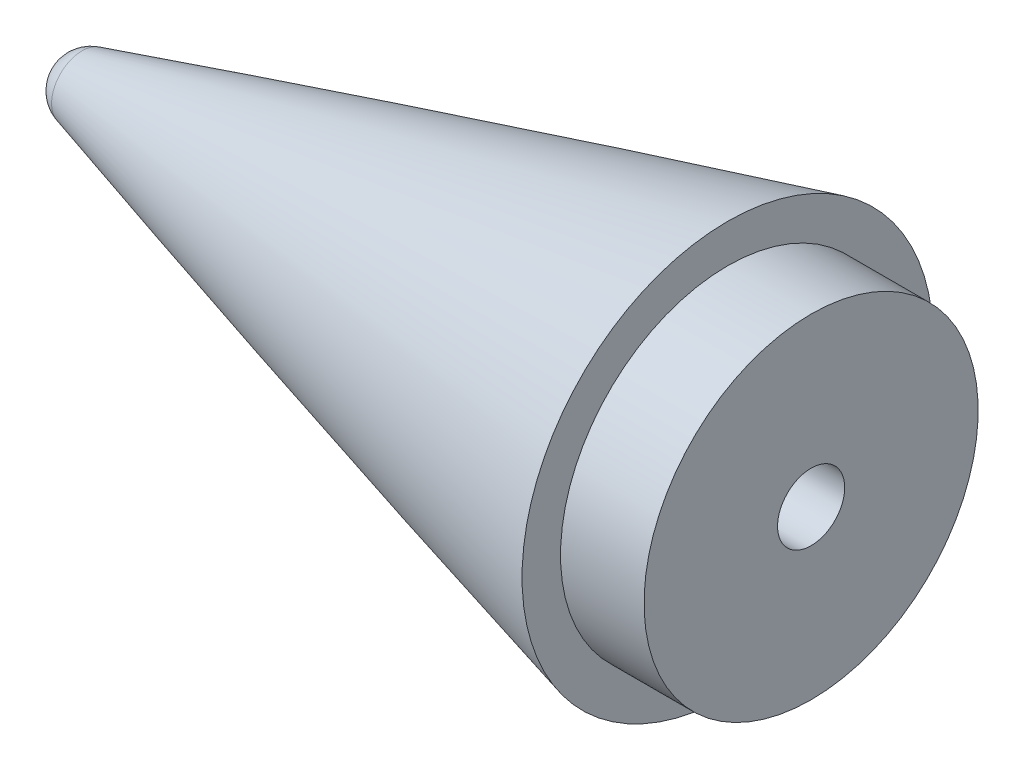
ISO-10303-21;
HEADER;
FILE_DESCRIPTION(('STEP AP214'),'2;1');
FILE_NAME('part.step','',(''),(''),'','','');
FILE_SCHEMA(('AUTOMOTIVE_DESIGN { 1 0 10303 214 1 1 1 1 }'));
ENDSEC;
DATA;
#1=APPLICATION_CONTEXT('core data for automotive mechanical design processes');
#2=APPLICATION_PROTOCOL_DEFINITION('international standard','automotive_design',2000,#1);
#3=PRODUCT_CONTEXT('',#1,'mechanical');
#4=PRODUCT('Part','Part','',(#3));
#5=PRODUCT_RELATED_PRODUCT_CATEGORY('part','',(#4));
#6=PRODUCT_DEFINITION_FORMATION('','',#4);
#7=PRODUCT_DEFINITION_CONTEXT('part definition',#1,'design');
#8=PRODUCT_DEFINITION('design','',#6,#7);
#9=PRODUCT_DEFINITION_SHAPE('','',#8);
#10=(LENGTH_UNIT() NAMED_UNIT(*) SI_UNIT(.MILLI.,.METRE.));
#11=(NAMED_UNIT(*) PLANE_ANGLE_UNIT() SI_UNIT($,.RADIAN.));
#12=(NAMED_UNIT(*) SI_UNIT($,.STERADIAN.) SOLID_ANGLE_UNIT());
#13=UNCERTAINTY_MEASURE_WITH_UNIT(LENGTH_MEASURE(1.E-05),#10,'distance_accuracy_value','');
#14=(GEOMETRIC_REPRESENTATION_CONTEXT(3) GLOBAL_UNCERTAINTY_ASSIGNED_CONTEXT((#13)) GLOBAL_UNIT_ASSIGNED_CONTEXT((#10,
#11,#12)) REPRESENTATION_CONTEXT('',''));
#15=CARTESIAN_POINT('',(0.,0.,0.));
#16=DIRECTION('',(0.,0.,1.));
#17=DIRECTION('',(1.,0.,0.));
#18=AXIS2_PLACEMENT_3D('',#15,#16,#17);
#19=CARTESIAN_POINT('',(-596.9,0.,0.));
#20=DIRECTION('',(1.,0.,0.));
#21=DIRECTION('',(0.,1.,0.));
#22=AXIS2_PLACEMENT_3D('',#19,#20,#21);
#23=PLANE('',#22);
#24=CARTESIAN_POINT('',(-596.9,0.,0.));
#25=DIRECTION('',(1.,0.,0.));
#26=DIRECTION('',(0.,1.,0.));
#27=AXIS2_PLACEMENT_3D('',#24,#25,#26);
#28=CIRCLE('',#27,12.7);
#29=CARTESIAN_POINT('',(-596.9,12.6999999999999,0.));
#30=VERTEX_POINT('',#29);
#31=EDGE_CURVE('E11',#30,#30,#28,.T.);
#32=ORIENTED_EDGE('',*,*,#31,.F.);
#33=EDGE_LOOP('',(#32));
#34=FACE_BOUND('',#33,.T.);
#35=CARTESIAN_POINT('',(-596.9,0.,0.));
#36=DIRECTION('',(1.,0.,0.));
#37=DIRECTION('',(0.,1.,0.));
#38=AXIS2_PLACEMENT_3D('',#35,#36,#37);
#39=CIRCLE('',#38,15.625315086326);
#40=CARTESIAN_POINT('',(-596.9,15.6253150863259,0.));
#41=VERTEX_POINT('',#40);
#42=EDGE_CURVE('E42',#41,#41,#39,.T.);
#43=ORIENTED_EDGE('',*,*,#42,.T.);
#44=EDGE_LOOP('',(#43));
#45=FACE_BOUND('',#44,.T.);
#46=ADVANCED_FACE('F39',(#34,#45),#23,.T.);
#47=CARTESIAN_POINT('',(-101.6,0.,0.));
#48=DIRECTION('',(1.,0.,0.));
#49=DIRECTION('',(0.,1.,0.));
#50=AXIS2_PLACEMENT_3D('',#47,#48,#49);
#51=DEGENERATE_TOROIDAL_SURFACE('',#50,1908.27390356564,1986.63290356564,.F.);
#52=CARTESIAN_POINT('',(-645.970071075142,0.,0.));
#53=DIRECTION('',(1.,0.,0.));
#54=DIRECTION('',(0.,1.,0.));
#55=AXIS2_PLACEMENT_3D('',#52,#53,#54);
#56=CIRCLE('',#55,2.32064244544155);
#57=CARTESIAN_POINT('',(-645.970071075142,2.32064244544147,0.));
#58=VERTEX_POINT('',#57);
#59=EDGE_CURVE('E63',#58,#58,#56,.T.);
#60=ORIENTED_EDGE('',*,*,#59,.T.);
#61=EDGE_LOOP('',(#60));
#62=FACE_BOUND('',#61,.T.);
#63=ORIENTED_EDGE('',*,*,#42,.F.);
#64=EDGE_LOOP('',(#63));
#65=FACE_BOUND('',#64,.T.);
#66=ADVANCED_FACE('F74',(#62,#65),#51,.F.);
#67=CARTESIAN_POINT('',(-645.308869411187,0.,0.));
#68=DIRECTION('',(1.,0.,0.));
#69=DIRECTION('',(0.,1.,0.));
#70=AXIS2_PLACEMENT_3D('',#67,#68,#69);
#71=SPHERICAL_SURFACE('',#70,2.41300000000017);
#72=ORIENTED_EDGE('',*,*,#59,.F.);
#73=EDGE_LOOP('',(#72));
#74=FACE_BOUND('',#73,.T.);
#75=ADVANCED_FACE('F76',(#74),#71,.T.);
#76=CARTESIAN_POINT('',(-590.55,0.,0.));
#77=DIRECTION('',(-1.,0.,0.));
#78=DIRECTION('',(0.,-1.,0.));
#79=AXIS2_PLACEMENT_3D('',#76,#77,#78);
#80=CYLINDRICAL_SURFACE('',#79,12.7);
#81=CARTESIAN_POINT('',(-590.55,0.,0.));
#82=DIRECTION('',(1.,0.,0.));
#83=DIRECTION('',(0.,1.,0.));
#84=AXIS2_PLACEMENT_3D('',#81,#82,#83);
#85=CIRCLE('',#84,12.7);
#86=CARTESIAN_POINT('',(-590.55,12.6999999999999,0.));
#87=VERTEX_POINT('',#86);
#88=EDGE_CURVE('E59',#87,#87,#85,.T.);
#89=ORIENTED_EDGE('',*,*,#88,.F.);
#90=EDGE_LOOP('',(#89));
#91=FACE_BOUND('',#90,.T.);
#92=ORIENTED_EDGE('',*,*,#31,.T.);
#93=EDGE_LOOP('',(#92));
#94=FACE_BOUND('',#93,.T.);
#95=ADVANCED_FACE('F80',(#91,#94),#80,.T.);
#96=CARTESIAN_POINT('',(-590.55,0.,0.));
#97=DIRECTION('',(1.,0.,0.));
#98=DIRECTION('',(0.,1.,0.));
#99=AXIS2_PLACEMENT_3D('',#96,#97,#98);
#100=PLANE('',#99);
#101=CARTESIAN_POINT('',(-590.55,0.,0.));
#102=DIRECTION('',(1.,0.,0.));
#103=DIRECTION('',(0.,0.,-1.));
#104=AXIS2_PLACEMENT_3D('',#101,#102,#103);
#105=CIRCLE('',#104,2.5527);
#106=CARTESIAN_POINT('',(-590.55,0.,-2.5527));
#107=VERTEX_POINT('',#106);
#108=EDGE_CURVE('E60',#107,#107,#105,.T.);
#109=ORIENTED_EDGE('',*,*,#108,.F.);
#110=EDGE_LOOP('',(#109));
#111=FACE_BOUND('',#110,.T.);
#112=ORIENTED_EDGE('',*,*,#88,.T.);
#113=EDGE_LOOP('',(#112));
#114=FACE_BOUND('',#113,.T.);
#115=ADVANCED_FACE('F53',(#111,#114),#100,.T.);
#116=CARTESIAN_POINT('',(-615.95,0.,0.));
#117=DIRECTION('',(1.,0.,0.));
#118=DIRECTION('',(0.,0.,-1.));
#119=AXIS2_PLACEMENT_3D('',#116,#117,#118);
#120=CONICAL_SURFACE('',#119,2.55269999999999,1.02974425867665);
#121=CARTESIAN_POINT('',(-617.483816902192,0.,0.));
#122=VERTEX_POINT('',#121);
#123=VERTEX_LOOP('',#122);
#124=FACE_BOUND('',#123,.T.);
#125=CARTESIAN_POINT('',(-615.95,0.,0.));
#126=DIRECTION('',(1.,0.,0.));
#127=DIRECTION('',(0.,0.,-1.));
#128=AXIS2_PLACEMENT_3D('',#125,#126,#127);
#129=CIRCLE('',#128,2.55269999999999);
#130=CARTESIAN_POINT('',(-615.95,0.,-2.55269999999999));
#131=VERTEX_POINT('',#130);
#132=EDGE_CURVE('E57',#131,#131,#129,.T.);
#133=ORIENTED_EDGE('',*,*,#132,.T.);
#134=EDGE_LOOP('',(#133));
#135=FACE_BOUND('',#134,.T.);
#136=ADVANCED_FACE('F49',(#124,#135),#120,.F.);
#137=CARTESIAN_POINT('',(-590.55,0.,0.));
#138=DIRECTION('',(1.,0.,0.));
#139=DIRECTION('',(0.,0.,-1.));
#140=AXIS2_PLACEMENT_3D('',#137,#138,#139);
#141=CYLINDRICAL_SURFACE('',#140,2.5527);
#142=ORIENTED_EDGE('',*,*,#132,.F.);
#143=EDGE_LOOP('',(#142));
#144=FACE_BOUND('',#143,.T.);
#145=ORIENTED_EDGE('',*,*,#108,.T.);
#146=EDGE_LOOP('',(#145));
#147=FACE_BOUND('',#146,.T.);
#148=ADVANCED_FACE('F52',(#144,#147),#141,.F.);
#149=CLOSED_SHELL('',(#46,#66,#75,#95,#115,#136,#148));
#150=MANIFOLD_SOLID_BREP('B2',#149);
#151=ADVANCED_BREP_SHAPE_REPRESENTATION('',(#18,#150),#14);
#152=SHAPE_DEFINITION_REPRESENTATION(#9,#151);
ENDSEC;
END-ISO-10303-21;
